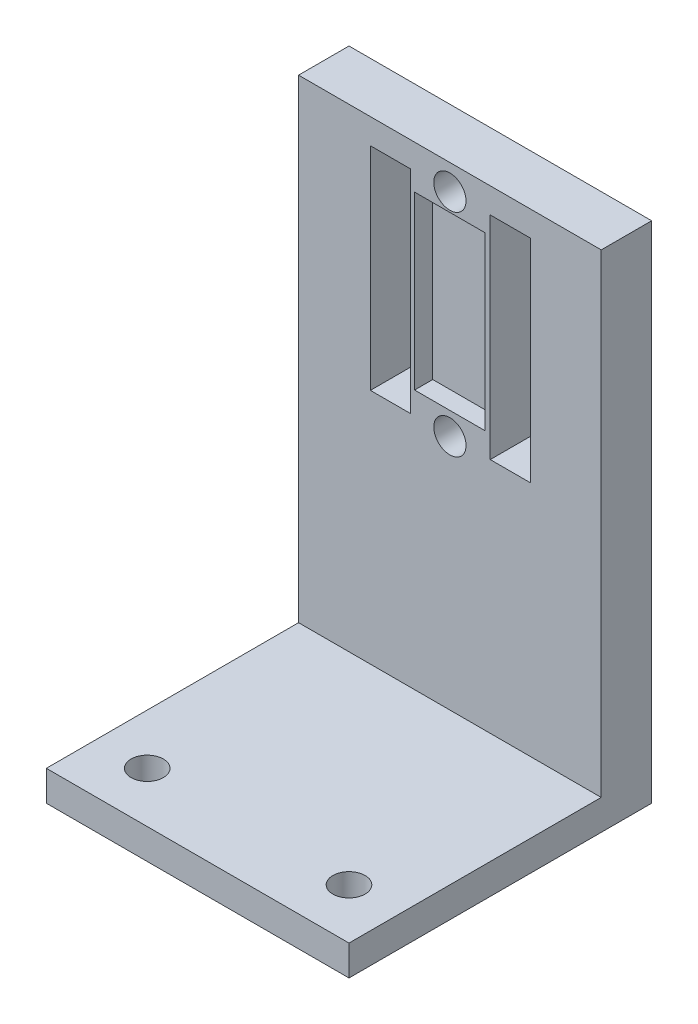
ISO-10303-21;
HEADER;
FILE_DESCRIPTION(('STEP AP214'),'2;1');
FILE_NAME('part.step','',(''),(''),'','','');
FILE_SCHEMA(('AUTOMOTIVE_DESIGN { 1 0 10303 214 1 1 1 1 }'));
ENDSEC;
DATA;
#1=APPLICATION_CONTEXT('core data for automotive mechanical design processes');
#2=APPLICATION_PROTOCOL_DEFINITION('international standard','automotive_design',2000,#1);
#3=PRODUCT_CONTEXT('',#1,'mechanical');
#4=PRODUCT('Part','Part','',(#3));
#5=PRODUCT_RELATED_PRODUCT_CATEGORY('part','',(#4));
#6=PRODUCT_DEFINITION_FORMATION('','',#4);
#7=PRODUCT_DEFINITION_CONTEXT('part definition',#1,'design');
#8=PRODUCT_DEFINITION('design','',#6,#7);
#9=PRODUCT_DEFINITION_SHAPE('','',#8);
#10=(LENGTH_UNIT() NAMED_UNIT(*) SI_UNIT(.MILLI.,.METRE.));
#11=(NAMED_UNIT(*) PLANE_ANGLE_UNIT() SI_UNIT($,.RADIAN.));
#12=(NAMED_UNIT(*) SI_UNIT($,.STERADIAN.) SOLID_ANGLE_UNIT());
#13=UNCERTAINTY_MEASURE_WITH_UNIT(LENGTH_MEASURE(1.E-05),#10,'distance_accuracy_value','');
#14=(GEOMETRIC_REPRESENTATION_CONTEXT(3) GLOBAL_UNCERTAINTY_ASSIGNED_CONTEXT((#13)) GLOBAL_UNIT_ASSIGNED_CONTEXT((#10,
#11,#12)) REPRESENTATION_CONTEXT('',''));
#15=CARTESIAN_POINT('',(0.,0.,0.));
#16=DIRECTION('',(0.,0.,1.));
#17=DIRECTION('',(1.,0.,0.));
#18=AXIS2_PLACEMENT_3D('',#15,#16,#17);
#19=CARTESIAN_POINT('',(15.,3.,0.));
#20=DIRECTION('',(1.,0.,0.));
#21=DIRECTION('',(0.,0.,-1.));
#22=AXIS2_PLACEMENT_3D('',#19,#20,#21);
#23=PLANE('',#22);
#24=DIRECTION('',(0.,0.,1.));
#25=VECTOR('',#24,1.);
#26=CARTESIAN_POINT('',(15.,0.,0.));
#27=LINE('',#26,#25);
#28=CARTESIAN_POINT('',(15.,0.,-30.));
#29=VERTEX_POINT('',#28);
#30=CARTESIAN_POINT('',(15.,0.,0.));
#31=VERTEX_POINT('',#30);
#32=EDGE_CURVE('E320',#29,#31,#27,.T.);
#33=ORIENTED_EDGE('',*,*,#32,.F.);
#34=DIRECTION('',(0.,-1.,0.));
#35=VECTOR('',#34,1.);
#36=CARTESIAN_POINT('',(15.,50.,-30.));
#37=LINE('',#36,#35);
#38=CARTESIAN_POINT('',(15.,50.,-30.));
#39=VERTEX_POINT('',#38);
#40=EDGE_CURVE('E287',#39,#29,#37,.T.);
#41=ORIENTED_EDGE('',*,*,#40,.F.);
#42=DIRECTION('',(0.,0.,1.));
#43=VECTOR('',#42,1.);
#44=CARTESIAN_POINT('',(15.,50.,0.));
#45=LINE('',#44,#43);
#46=CARTESIAN_POINT('',(15.,50.,-25.));
#47=VERTEX_POINT('',#46);
#48=EDGE_CURVE('E276',#39,#47,#45,.T.);
#49=ORIENTED_EDGE('',*,*,#48,.T.);
#50=DIRECTION('',(0.,-1.,0.));
#51=VECTOR('',#50,1.);
#52=CARTESIAN_POINT('',(15.,50.,-25.));
#53=LINE('',#52,#51);
#54=CARTESIAN_POINT('',(15.,3.,-25.));
#55=VERTEX_POINT('',#54);
#56=EDGE_CURVE('E290',#47,#55,#53,.T.);
#57=ORIENTED_EDGE('',*,*,#56,.T.);
#58=DIRECTION('',(0.,0.,1.));
#59=VECTOR('',#58,1.);
#60=CARTESIAN_POINT('',(15.,3.,0.));
#61=LINE('',#60,#59);
#62=CARTESIAN_POINT('',(15.,3.,0.));
#63=VERTEX_POINT('',#62);
#64=EDGE_CURVE('E304',#55,#63,#61,.T.);
#65=ORIENTED_EDGE('',*,*,#64,.T.);
#66=DIRECTION('',(0.,-1.,0.));
#67=VECTOR('',#66,1.);
#68=CARTESIAN_POINT('',(15.,3.,0.));
#69=LINE('',#68,#67);
#70=EDGE_CURVE('E42',#63,#31,#69,.T.);
#71=ORIENTED_EDGE('',*,*,#70,.T.);
#72=EDGE_LOOP('',(#33,#41,#49,#57,#65,#71));
#73=FACE_BOUND('',#72,.T.);
#74=ADVANCED_FACE('F34',(#73),#23,.T.);
#75=CARTESIAN_POINT('',(-15.,3.,0.));
#76=DIRECTION('',(-1.,0.,0.));
#77=DIRECTION('',(0.,0.,1.));
#78=AXIS2_PLACEMENT_3D('',#75,#76,#77);
#79=PLANE('',#78);
#80=DIRECTION('',(0.,0.,-1.));
#81=VECTOR('',#80,1.);
#82=CARTESIAN_POINT('',(-15.,0.,0.));
#83=LINE('',#82,#81);
#84=CARTESIAN_POINT('',(-15.,0.,0.));
#85=VERTEX_POINT('',#84);
#86=CARTESIAN_POINT('',(-15.,0.,-30.));
#87=VERTEX_POINT('',#86);
#88=EDGE_CURVE('E323',#85,#87,#83,.T.);
#89=ORIENTED_EDGE('',*,*,#88,.F.);
#90=DIRECTION('',(0.,-1.,0.));
#91=VECTOR('',#90,1.);
#92=CARTESIAN_POINT('',(-15.,3.,0.));
#93=LINE('',#92,#91);
#94=CARTESIAN_POINT('',(-15.,3.,0.));
#95=VERTEX_POINT('',#94);
#96=EDGE_CURVE('E11',#95,#85,#93,.T.);
#97=ORIENTED_EDGE('',*,*,#96,.F.);
#98=DIRECTION('',(0.,0.,-1.));
#99=VECTOR('',#98,1.);
#100=CARTESIAN_POINT('',(-15.,3.,0.));
#101=LINE('',#100,#99);
#102=CARTESIAN_POINT('',(-15.,3.,-25.));
#103=VERTEX_POINT('',#102);
#104=EDGE_CURVE('E310',#95,#103,#101,.T.);
#105=ORIENTED_EDGE('',*,*,#104,.T.);
#106=DIRECTION('',(0.,-1.,0.));
#107=VECTOR('',#106,1.);
#108=CARTESIAN_POINT('',(-15.,50.,-25.));
#109=LINE('',#108,#107);
#110=CARTESIAN_POINT('',(-15.,50.,-25.));
#111=VERTEX_POINT('',#110);
#112=EDGE_CURVE('E293',#111,#103,#109,.T.);
#113=ORIENTED_EDGE('',*,*,#112,.F.);
#114=DIRECTION('',(0.,0.,-1.));
#115=VECTOR('',#114,1.);
#116=CARTESIAN_POINT('',(-15.,50.,0.));
#117=LINE('',#116,#115);
#118=CARTESIAN_POINT('',(-15.,50.,-30.));
#119=VERTEX_POINT('',#118);
#120=EDGE_CURVE('E271',#111,#119,#117,.T.);
#121=ORIENTED_EDGE('',*,*,#120,.T.);
#122=DIRECTION('',(0.,-1.,0.));
#123=VECTOR('',#122,1.);
#124=CARTESIAN_POINT('',(-15.,50.,-30.));
#125=LINE('',#124,#123);
#126=EDGE_CURVE('E282',#119,#87,#125,.T.);
#127=ORIENTED_EDGE('',*,*,#126,.T.);
#128=EDGE_LOOP('',(#89,#97,#105,#113,#121,#127));
#129=FACE_BOUND('',#128,.T.);
#130=ADVANCED_FACE('F351',(#129),#79,.T.);
#131=CARTESIAN_POINT('',(-10.,3.,-5.));
#132=DIRECTION('',(0.,-1.,0.));
#133=DIRECTION('',(0.,0.,-1.));
#134=AXIS2_PLACEMENT_3D('',#131,#132,#133);
#135=CYLINDRICAL_SURFACE('',#134,1.6);
#136=CARTESIAN_POINT('',(-10.,3.,-5.));
#137=DIRECTION('',(0.,1.,0.));
#138=DIRECTION('',(0.,0.,1.));
#139=AXIS2_PLACEMENT_3D('',#136,#137,#138);
#140=CIRCLE('',#139,1.6);
#141=CARTESIAN_POINT('',(-10.,3.,-3.4));
#142=VERTEX_POINT('',#141);
#143=EDGE_CURVE('E300',#142,#142,#140,.T.);
#144=ORIENTED_EDGE('',*,*,#143,.T.);
#145=EDGE_LOOP('',(#144));
#146=FACE_BOUND('',#145,.T.);
#147=CARTESIAN_POINT('',(-10.,0.,-5.));
#148=DIRECTION('',(0.,1.,0.));
#149=DIRECTION('',(0.,0.,1.));
#150=AXIS2_PLACEMENT_3D('',#147,#148,#149);
#151=CIRCLE('',#150,1.6);
#152=CARTESIAN_POINT('',(-10.,0.,-3.4));
#153=VERTEX_POINT('',#152);
#154=EDGE_CURVE('E317',#153,#153,#151,.T.);
#155=ORIENTED_EDGE('',*,*,#154,.F.);
#156=EDGE_LOOP('',(#155));
#157=FACE_BOUND('',#156,.T.);
#158=ADVANCED_FACE('F353',(#146,#157),#135,.F.);
#159=CARTESIAN_POINT('',(10.,3.,-5.));
#160=DIRECTION('',(0.,-1.,0.));
#161=DIRECTION('',(0.,0.,-1.));
#162=AXIS2_PLACEMENT_3D('',#159,#160,#161);
#163=CYLINDRICAL_SURFACE('',#162,1.6);
#164=CARTESIAN_POINT('',(10.,3.,-5.));
#165=DIRECTION('',(0.,1.,0.));
#166=DIRECTION('',(0.,0.,1.));
#167=AXIS2_PLACEMENT_3D('',#164,#165,#166);
#168=CIRCLE('',#167,1.6);
#169=CARTESIAN_POINT('',(10.,3.,-3.4));
#170=VERTEX_POINT('',#169);
#171=EDGE_CURVE('E297',#170,#170,#168,.T.);
#172=ORIENTED_EDGE('',*,*,#171,.T.);
#173=EDGE_LOOP('',(#172));
#174=FACE_BOUND('',#173,.T.);
#175=CARTESIAN_POINT('',(10.,0.,-5.));
#176=DIRECTION('',(0.,1.,0.));
#177=DIRECTION('',(0.,0.,1.));
#178=AXIS2_PLACEMENT_3D('',#175,#176,#177);
#179=CIRCLE('',#178,1.6);
#180=CARTESIAN_POINT('',(10.,0.,-3.4));
#181=VERTEX_POINT('',#180);
#182=EDGE_CURVE('E296',#181,#181,#179,.T.);
#183=ORIENTED_EDGE('',*,*,#182,.F.);
#184=EDGE_LOOP('',(#183));
#185=FACE_BOUND('',#184,.T.);
#186=ADVANCED_FACE('F36',(#174,#185),#163,.F.);
#187=CARTESIAN_POINT('',(0.,3.,0.));
#188=DIRECTION('',(0.,0.,-1.));
#189=DIRECTION('',(-1.,0.,0.));
#190=AXIS2_PLACEMENT_3D('',#187,#188,#189);
#191=PLANE('',#190);
#192=DIRECTION('',(1.,0.,0.));
#193=VECTOR('',#192,1.);
#194=CARTESIAN_POINT('',(0.,0.,0.));
#195=LINE('',#194,#193);
#196=EDGE_CURVE('E301',#85,#31,#195,.T.);
#197=ORIENTED_EDGE('',*,*,#196,.T.);
#198=ORIENTED_EDGE('',*,*,#70,.F.);
#199=DIRECTION('',(1.,0.,0.));
#200=VECTOR('',#199,1.);
#201=CARTESIAN_POINT('',(0.,3.,0.));
#202=LINE('',#201,#200);
#203=EDGE_CURVE('E313',#95,#63,#202,.T.);
#204=ORIENTED_EDGE('',*,*,#203,.F.);
#205=ORIENTED_EDGE('',*,*,#96,.T.);
#206=EDGE_LOOP('',(#197,#198,#204,#205));
#207=FACE_BOUND('',#206,.T.);
#208=ADVANCED_FACE('F331',(#207),#191,.F.);
#209=CARTESIAN_POINT('',(0.,3.,0.));
#210=DIRECTION('',(0.,1.,0.));
#211=DIRECTION('',(0.,0.,1.));
#212=AXIS2_PLACEMENT_3D('',#209,#210,#211);
#213=PLANE('',#212);
#214=ORIENTED_EDGE('',*,*,#171,.F.);
#215=EDGE_LOOP('',(#214));
#216=FACE_BOUND('',#215,.T.);
#217=ORIENTED_EDGE('',*,*,#143,.F.);
#218=EDGE_LOOP('',(#217));
#219=FACE_BOUND('',#218,.T.);
#220=ORIENTED_EDGE('',*,*,#64,.F.);
#221=DIRECTION('',(1.,0.,0.));
#222=VECTOR('',#221,1.);
#223=CARTESIAN_POINT('',(0.,3.,-25.));
#224=LINE('',#223,#222);
#225=EDGE_CURVE('E307',#103,#55,#224,.T.);
#226=ORIENTED_EDGE('',*,*,#225,.F.);
#227=ORIENTED_EDGE('',*,*,#104,.F.);
#228=ORIENTED_EDGE('',*,*,#203,.T.);
#229=EDGE_LOOP('',(#220,#226,#227,#228));
#230=FACE_BOUND('',#229,.T.);
#231=ADVANCED_FACE('F349',(#216,#219,#230),#213,.T.);
#232=CARTESIAN_POINT('',(0.,0.,0.));
#233=DIRECTION('',(0.,1.,0.));
#234=DIRECTION('',(0.,0.,1.));
#235=AXIS2_PLACEMENT_3D('',#232,#233,#234);
#236=PLANE('',#235);
#237=ORIENTED_EDGE('',*,*,#182,.T.);
#238=EDGE_LOOP('',(#237));
#239=FACE_BOUND('',#238,.T.);
#240=ORIENTED_EDGE('',*,*,#154,.T.);
#241=EDGE_LOOP('',(#240));
#242=FACE_BOUND('',#241,.T.);
#243=ORIENTED_EDGE('',*,*,#32,.T.);
#244=ORIENTED_EDGE('',*,*,#196,.F.);
#245=ORIENTED_EDGE('',*,*,#88,.T.);
#246=DIRECTION('',(1.,0.,0.));
#247=VECTOR('',#246,1.);
#248=CARTESIAN_POINT('',(0.,0.,-30.));
#249=LINE('',#248,#247);
#250=EDGE_CURVE('E268',#87,#29,#249,.T.);
#251=ORIENTED_EDGE('',*,*,#250,.T.);
#252=EDGE_LOOP('',(#243,#244,#245,#251));
#253=FACE_BOUND('',#252,.T.);
#254=ADVANCED_FACE('F334',(#239,#242,#253),#236,.F.);
#255=CARTESIAN_POINT('',(0.,50.,-25.));
#256=DIRECTION('',(0.,0.,-1.));
#257=DIRECTION('',(-1.,0.,0.));
#258=AXIS2_PLACEMENT_3D('',#255,#256,#257);
#259=PLANE('',#258);
#260=DIRECTION('',(1.,0.,0.));
#261=VECTOR('',#260,1.);
#262=CARTESIAN_POINT('',(-3.5,28.7198675068723,-25.));
#263=LINE('',#262,#261);
#264=CARTESIAN_POINT('',(-3.5,28.7198675068723,-25.));
#265=VERTEX_POINT('',#264);
#266=CARTESIAN_POINT('',(3.5,28.7198675068723,-25.));
#267=VERTEX_POINT('',#266);
#268=EDGE_CURVE('E187',#265,#267,#263,.T.);
#269=ORIENTED_EDGE('',*,*,#268,.F.);
#270=DIRECTION('',(0.,-1.,0.));
#271=VECTOR('',#270,1.);
#272=CARTESIAN_POINT('',(-3.5,28.7198675068723,-25.));
#273=LINE('',#272,#271);
#274=CARTESIAN_POINT('',(-3.5,45.7130165422583,-25.));
#275=VERTEX_POINT('',#274);
#276=EDGE_CURVE('E49',#275,#265,#273,.T.);
#277=ORIENTED_EDGE('',*,*,#276,.F.);
#278=DIRECTION('',(-1.,0.,0.));
#279=VECTOR('',#278,1.);
#280=CARTESIAN_POINT('',(-3.5,45.7130165422583,-25.));
#281=LINE('',#280,#279);
#282=CARTESIAN_POINT('',(3.5,45.7130165422583,-25.));
#283=VERTEX_POINT('',#282);
#284=EDGE_CURVE('E178',#283,#275,#281,.T.);
#285=ORIENTED_EDGE('',*,*,#284,.F.);
#286=DIRECTION('',(0.,1.,0.));
#287=VECTOR('',#286,1.);
#288=CARTESIAN_POINT('',(3.5,45.7130165422583,-25.));
#289=LINE('',#288,#287);
#290=EDGE_CURVE('E181',#267,#283,#289,.T.);
#291=ORIENTED_EDGE('',*,*,#290,.F.);
#292=EDGE_LOOP('',(#269,#277,#285,#291));
#293=FACE_BOUND('',#292,.T.);
#294=DIRECTION('',(1.,0.,0.));
#295=VECTOR('',#294,1.);
#296=CARTESIAN_POINT('',(-3.87991739207283,26.5,-25.));
#297=LINE('',#296,#295);
#298=CARTESIAN_POINT('',(-7.87991739207283,26.5,-25.));
#299=VERTEX_POINT('',#298);
#300=CARTESIAN_POINT('',(-3.87991739207283,26.5,-25.));
#301=VERTEX_POINT('',#300);
#302=EDGE_CURVE('E245',#299,#301,#297,.T.);
#303=ORIENTED_EDGE('',*,*,#302,.F.);
#304=DIRECTION('',(0.,-1.,0.));
#305=VECTOR('',#304,1.);
#306=CARTESIAN_POINT('',(-7.87991739207283,26.5,-25.));
#307=LINE('',#306,#305);
#308=CARTESIAN_POINT('',(-7.87991739207283,47.5,-25.));
#309=VERTEX_POINT('',#308);
#310=EDGE_CURVE('E57',#309,#299,#307,.T.);
#311=ORIENTED_EDGE('',*,*,#310,.F.);
#312=DIRECTION('',(-1.,0.,0.));
#313=VECTOR('',#312,1.);
#314=CARTESIAN_POINT('',(-7.87991739207283,47.5,-25.));
#315=LINE('',#314,#313);
#316=CARTESIAN_POINT('',(-3.87991739207283,47.5,-25.));
#317=VERTEX_POINT('',#316);
#318=EDGE_CURVE('E234',#317,#309,#315,.T.);
#319=ORIENTED_EDGE('',*,*,#318,.F.);
#320=DIRECTION('',(0.,1.,0.));
#321=VECTOR('',#320,1.);
#322=CARTESIAN_POINT('',(-3.87991739207283,47.5,-25.));
#323=LINE('',#322,#321);
#324=EDGE_CURVE('E248',#301,#317,#323,.T.);
#325=ORIENTED_EDGE('',*,*,#324,.F.);
#326=EDGE_LOOP('',(#303,#311,#319,#325));
#327=FACE_BOUND('',#326,.T.);
#328=DIRECTION('',(1.,0.,0.));
#329=VECTOR('',#328,1.);
#330=CARTESIAN_POINT('',(4.,26.5,-25.));
#331=LINE('',#330,#329);
#332=CARTESIAN_POINT('',(4.,26.5,-25.));
#333=VERTEX_POINT('',#332);
#334=CARTESIAN_POINT('',(8.,26.5,-25.));
#335=VERTEX_POINT('',#334);
#336=EDGE_CURVE('E212',#333,#335,#331,.T.);
#337=ORIENTED_EDGE('',*,*,#336,.F.);
#338=DIRECTION('',(0.,-1.,0.));
#339=VECTOR('',#338,1.);
#340=CARTESIAN_POINT('',(4.,47.5,-25.));
#341=LINE('',#340,#339);
#342=CARTESIAN_POINT('',(4.,47.5,-25.));
#343=VERTEX_POINT('',#342);
#344=EDGE_CURVE('E210',#343,#333,#341,.T.);
#345=ORIENTED_EDGE('',*,*,#344,.F.);
#346=DIRECTION('',(-1.,0.,0.));
#347=VECTOR('',#346,1.);
#348=CARTESIAN_POINT('',(8.,47.5,-25.));
#349=LINE('',#348,#347);
#350=CARTESIAN_POINT('',(8.,47.5,-25.));
#351=VERTEX_POINT('',#350);
#352=EDGE_CURVE('E200',#351,#343,#349,.T.);
#353=ORIENTED_EDGE('',*,*,#352,.F.);
#354=DIRECTION('',(0.,1.,0.));
#355=VECTOR('',#354,1.);
#356=CARTESIAN_POINT('',(8.,26.5,-25.));
#357=LINE('',#356,#355);
#358=EDGE_CURVE('E216',#335,#351,#357,.T.);
#359=ORIENTED_EDGE('',*,*,#358,.F.);
#360=EDGE_LOOP('',(#337,#345,#353,#359));
#361=FACE_BOUND('',#360,.T.);
#362=CARTESIAN_POINT('',(0.,26.5,-25.));
#363=DIRECTION('',(0.,0.,1.));
#364=DIRECTION('',(1.,0.,0.));
#365=AXIS2_PLACEMENT_3D('',#362,#363,#364);
#366=CIRCLE('',#365,1.6);
#367=CARTESIAN_POINT('',(1.6,26.5,-25.));
#368=VERTEX_POINT('',#367);
#369=EDGE_CURVE('E223',#368,#368,#366,.T.);
#370=ORIENTED_EDGE('',*,*,#369,.F.);
#371=EDGE_LOOP('',(#370));
#372=FACE_BOUND('',#371,.T.);
#373=CARTESIAN_POINT('',(0.,47.5,-25.));
#374=DIRECTION('',(0.,0.,1.));
#375=DIRECTION('',(1.,0.,0.));
#376=AXIS2_PLACEMENT_3D('',#373,#374,#375);
#377=CIRCLE('',#376,1.6);
#378=CARTESIAN_POINT('',(1.6,47.5,-25.));
#379=VERTEX_POINT('',#378);
#380=EDGE_CURVE('E262',#379,#379,#377,.T.);
#381=ORIENTED_EDGE('',*,*,#380,.F.);
#382=EDGE_LOOP('',(#381));
#383=FACE_BOUND('',#382,.T.);
#384=ORIENTED_EDGE('',*,*,#112,.T.);
#385=ORIENTED_EDGE('',*,*,#225,.T.);
#386=ORIENTED_EDGE('',*,*,#56,.F.);
#387=DIRECTION('',(1.,0.,0.));
#388=VECTOR('',#387,1.);
#389=CARTESIAN_POINT('',(0.,50.,-25.));
#390=LINE('',#389,#388);
#391=EDGE_CURVE('E274',#111,#47,#390,.T.);
#392=ORIENTED_EDGE('',*,*,#391,.F.);
#393=EDGE_LOOP('',(#384,#385,#386,#392));
#394=FACE_BOUND('',#393,.T.);
#395=ADVANCED_FACE('F346',(#293,#327,#361,#372,#383,#394),#259,.F.);
#396=CARTESIAN_POINT('',(0.,50.,-30.));
#397=DIRECTION('',(0.,0.,-1.));
#398=DIRECTION('',(-1.,0.,0.));
#399=AXIS2_PLACEMENT_3D('',#396,#397,#398);
#400=PLANE('',#399);
#401=DIRECTION('',(0.,-1.,0.));
#402=VECTOR('',#401,1.);
#403=CARTESIAN_POINT('',(-7.87991739207283,26.5,-30.));
#404=LINE('',#403,#402);
#405=CARTESIAN_POINT('',(-7.87991739207283,47.5,-30.));
#406=VERTEX_POINT('',#405);
#407=CARTESIAN_POINT('',(-7.87991739207283,26.5,-30.));
#408=VERTEX_POINT('',#407);
#409=EDGE_CURVE('E230',#406,#408,#404,.T.);
#410=ORIENTED_EDGE('',*,*,#409,.T.);
#411=DIRECTION('',(1.,0.,0.));
#412=VECTOR('',#411,1.);
#413=CARTESIAN_POINT('',(-3.87991739207283,26.5,-30.));
#414=LINE('',#413,#412);
#415=CARTESIAN_POINT('',(-3.87991739207283,26.5,-30.));
#416=VERTEX_POINT('',#415);
#417=EDGE_CURVE('E233',#408,#416,#414,.T.);
#418=ORIENTED_EDGE('',*,*,#417,.T.);
#419=DIRECTION('',(0.,1.,0.));
#420=VECTOR('',#419,1.);
#421=CARTESIAN_POINT('',(-3.87991739207283,47.5,-30.));
#422=LINE('',#421,#420);
#423=CARTESIAN_POINT('',(-3.87991739207283,47.5,-30.));
#424=VERTEX_POINT('',#423);
#425=EDGE_CURVE('E237',#416,#424,#422,.T.);
#426=ORIENTED_EDGE('',*,*,#425,.T.);
#427=DIRECTION('',(-1.,0.,0.));
#428=VECTOR('',#427,1.);
#429=CARTESIAN_POINT('',(-7.87991739207283,47.5,-30.));
#430=LINE('',#429,#428);
#431=EDGE_CURVE('E240',#424,#406,#430,.T.);
#432=ORIENTED_EDGE('',*,*,#431,.T.);
#433=EDGE_LOOP('',(#410,#418,#426,#432));
#434=FACE_BOUND('',#433,.T.);
#435=DIRECTION('',(0.,-1.,0.));
#436=VECTOR('',#435,1.);
#437=CARTESIAN_POINT('',(4.,47.5,-30.));
#438=LINE('',#437,#436);
#439=CARTESIAN_POINT('',(4.,47.5,-30.));
#440=VERTEX_POINT('',#439);
#441=CARTESIAN_POINT('',(4.,26.5,-30.));
#442=VERTEX_POINT('',#441);
#443=EDGE_CURVE('E196',#440,#442,#438,.T.);
#444=ORIENTED_EDGE('',*,*,#443,.T.);
#445=DIRECTION('',(1.,0.,0.));
#446=VECTOR('',#445,1.);
#447=CARTESIAN_POINT('',(4.,26.5,-30.));
#448=LINE('',#447,#446);
#449=CARTESIAN_POINT('',(8.,26.5,-30.));
#450=VERTEX_POINT('',#449);
#451=EDGE_CURVE('E199',#442,#450,#448,.T.);
#452=ORIENTED_EDGE('',*,*,#451,.T.);
#453=DIRECTION('',(0.,1.,0.));
#454=VECTOR('',#453,1.);
#455=CARTESIAN_POINT('',(8.,26.5,-30.));
#456=LINE('',#455,#454);
#457=CARTESIAN_POINT('',(8.,47.5,-30.));
#458=VERTEX_POINT('',#457);
#459=EDGE_CURVE('E203',#450,#458,#456,.T.);
#460=ORIENTED_EDGE('',*,*,#459,.T.);
#461=DIRECTION('',(-1.,0.,0.));
#462=VECTOR('',#461,1.);
#463=CARTESIAN_POINT('',(8.,47.5,-30.));
#464=LINE('',#463,#462);
#465=EDGE_CURVE('E206',#458,#440,#464,.T.);
#466=ORIENTED_EDGE('',*,*,#465,.T.);
#467=EDGE_LOOP('',(#444,#452,#460,#466));
#468=FACE_BOUND('',#467,.T.);
#469=CARTESIAN_POINT('',(0.,26.5,-30.));
#470=DIRECTION('',(0.,0.,1.));
#471=DIRECTION('',(1.,0.,0.));
#472=AXIS2_PLACEMENT_3D('',#469,#470,#471);
#473=CIRCLE('',#472,1.6);
#474=CARTESIAN_POINT('',(1.6,26.5,-30.));
#475=VERTEX_POINT('',#474);
#476=EDGE_CURVE('E259',#475,#475,#473,.T.);
#477=ORIENTED_EDGE('',*,*,#476,.T.);
#478=EDGE_LOOP('',(#477));
#479=FACE_BOUND('',#478,.T.);
#480=CARTESIAN_POINT('',(0.,47.5,-30.));
#481=DIRECTION('',(0.,0.,1.));
#482=DIRECTION('',(1.,0.,0.));
#483=AXIS2_PLACEMENT_3D('',#480,#481,#482);
#484=CIRCLE('',#483,1.6);
#485=CARTESIAN_POINT('',(1.6,47.5,-30.));
#486=VERTEX_POINT('',#485);
#487=EDGE_CURVE('E265',#486,#486,#484,.T.);
#488=ORIENTED_EDGE('',*,*,#487,.T.);
#489=EDGE_LOOP('',(#488));
#490=FACE_BOUND('',#489,.T.);
#491=ORIENTED_EDGE('',*,*,#250,.F.);
#492=ORIENTED_EDGE('',*,*,#126,.F.);
#493=DIRECTION('',(1.,0.,0.));
#494=VECTOR('',#493,1.);
#495=CARTESIAN_POINT('',(0.,50.,-30.));
#496=LINE('',#495,#494);
#497=EDGE_CURVE('E279',#119,#39,#496,.T.);
#498=ORIENTED_EDGE('',*,*,#497,.T.);
#499=ORIENTED_EDGE('',*,*,#40,.T.);
#500=EDGE_LOOP('',(#491,#492,#498,#499));
#501=FACE_BOUND('',#500,.T.);
#502=ADVANCED_FACE('F337',(#434,#468,#479,#490,#501),#400,.T.);
#503=CARTESIAN_POINT('',(0.,50.,0.));
#504=DIRECTION('',(0.,1.,0.));
#505=DIRECTION('',(0.,0.,1.));
#506=AXIS2_PLACEMENT_3D('',#503,#504,#505);
#507=PLANE('',#506);
#508=ORIENTED_EDGE('',*,*,#120,.F.);
#509=ORIENTED_EDGE('',*,*,#391,.T.);
#510=ORIENTED_EDGE('',*,*,#48,.F.);
#511=ORIENTED_EDGE('',*,*,#497,.F.);
#512=EDGE_LOOP('',(#508,#509,#510,#511));
#513=FACE_BOUND('',#512,.T.);
#514=ADVANCED_FACE('F342',(#513),#507,.T.);
#515=CARTESIAN_POINT('',(0.,47.5,-30.));
#516=DIRECTION('',(0.,0.,1.));
#517=DIRECTION('',(1.,0.,0.));
#518=AXIS2_PLACEMENT_3D('',#515,#516,#517);
#519=CYLINDRICAL_SURFACE('',#518,1.6);
#520=ORIENTED_EDGE('',*,*,#487,.F.);
#521=EDGE_LOOP('',(#520));
#522=FACE_BOUND('',#521,.T.);
#523=ORIENTED_EDGE('',*,*,#380,.T.);
#524=EDGE_LOOP('',(#523));
#525=FACE_BOUND('',#524,.T.);
#526=ADVANCED_FACE('F378',(#522,#525),#519,.F.);
#527=CARTESIAN_POINT('',(0.,26.5,-30.));
#528=DIRECTION('',(0.,0.,1.));
#529=DIRECTION('',(1.,0.,0.));
#530=AXIS2_PLACEMENT_3D('',#527,#528,#529);
#531=CYLINDRICAL_SURFACE('',#530,1.6);
#532=ORIENTED_EDGE('',*,*,#476,.F.);
#533=EDGE_LOOP('',(#532));
#534=FACE_BOUND('',#533,.T.);
#535=ORIENTED_EDGE('',*,*,#369,.T.);
#536=EDGE_LOOP('',(#535));
#537=FACE_BOUND('',#536,.T.);
#538=ADVANCED_FACE('F381',(#534,#537),#531,.F.);
#539=CARTESIAN_POINT('',(4.,47.5,-30.));
#540=DIRECTION('',(-1.,0.,0.));
#541=DIRECTION('',(0.,0.,1.));
#542=AXIS2_PLACEMENT_3D('',#539,#540,#541);
#543=PLANE('',#542);
#544=ORIENTED_EDGE('',*,*,#344,.T.);
#545=DIRECTION('',(0.,0.,1.));
#546=VECTOR('',#545,1.);
#547=CARTESIAN_POINT('',(4.,26.5,-30.));
#548=LINE('',#547,#546);
#549=EDGE_CURVE('E209',#442,#333,#548,.T.);
#550=ORIENTED_EDGE('',*,*,#549,.F.);
#551=ORIENTED_EDGE('',*,*,#443,.F.);
#552=DIRECTION('',(0.,0.,1.));
#553=VECTOR('',#552,1.);
#554=CARTESIAN_POINT('',(4.,47.5,-30.));
#555=LINE('',#554,#553);
#556=EDGE_CURVE('E221',#440,#343,#555,.T.);
#557=ORIENTED_EDGE('',*,*,#556,.T.);
#558=EDGE_LOOP('',(#544,#550,#551,#557));
#559=FACE_BOUND('',#558,.T.);
#560=ADVANCED_FACE('F385',(#559),#543,.F.);
#561=CARTESIAN_POINT('',(8.,47.5,-30.));
#562=DIRECTION('',(0.,1.,0.));
#563=DIRECTION('',(0.,0.,1.));
#564=AXIS2_PLACEMENT_3D('',#561,#562,#563);
#565=PLANE('',#564);
#566=ORIENTED_EDGE('',*,*,#352,.T.);
#567=ORIENTED_EDGE('',*,*,#556,.F.);
#568=ORIENTED_EDGE('',*,*,#465,.F.);
#569=DIRECTION('',(0.,0.,1.));
#570=VECTOR('',#569,1.);
#571=CARTESIAN_POINT('',(8.,47.5,-30.));
#572=LINE('',#571,#570);
#573=EDGE_CURVE('E224',#458,#351,#572,.T.);
#574=ORIENTED_EDGE('',*,*,#573,.T.);
#575=EDGE_LOOP('',(#566,#567,#568,#574));
#576=FACE_BOUND('',#575,.T.);
#577=ADVANCED_FACE('F405',(#576),#565,.F.);
#578=CARTESIAN_POINT('',(8.,26.5,-30.));
#579=DIRECTION('',(1.,0.,0.));
#580=DIRECTION('',(0.,0.,-1.));
#581=AXIS2_PLACEMENT_3D('',#578,#579,#580);
#582=PLANE('',#581);
#583=ORIENTED_EDGE('',*,*,#358,.T.);
#584=ORIENTED_EDGE('',*,*,#573,.F.);
#585=ORIENTED_EDGE('',*,*,#459,.F.);
#586=DIRECTION('',(0.,0.,1.));
#587=VECTOR('',#586,1.);
#588=CARTESIAN_POINT('',(8.,26.5,-30.));
#589=LINE('',#588,#587);
#590=EDGE_CURVE('E226',#450,#335,#589,.T.);
#591=ORIENTED_EDGE('',*,*,#590,.T.);
#592=EDGE_LOOP('',(#583,#584,#585,#591));
#593=FACE_BOUND('',#592,.T.);
#594=ADVANCED_FACE('F409',(#593),#582,.F.);
#595=CARTESIAN_POINT('',(4.,26.5,-30.));
#596=DIRECTION('',(0.,-1.,0.));
#597=DIRECTION('',(0.,0.,-1.));
#598=AXIS2_PLACEMENT_3D('',#595,#596,#597);
#599=PLANE('',#598);
#600=ORIENTED_EDGE('',*,*,#336,.T.);
#601=ORIENTED_EDGE('',*,*,#590,.F.);
#602=ORIENTED_EDGE('',*,*,#451,.F.);
#603=ORIENTED_EDGE('',*,*,#549,.T.);
#604=EDGE_LOOP('',(#600,#601,#602,#603));
#605=FACE_BOUND('',#604,.T.);
#606=ADVANCED_FACE('F391',(#605),#599,.F.);
#607=CARTESIAN_POINT('',(-7.87991739207283,26.5,-30.));
#608=DIRECTION('',(-1.,0.,0.));
#609=DIRECTION('',(0.,0.,1.));
#610=AXIS2_PLACEMENT_3D('',#607,#608,#609);
#611=PLANE('',#610);
#612=ORIENTED_EDGE('',*,*,#310,.T.);
#613=DIRECTION('',(0.,0.,1.));
#614=VECTOR('',#613,1.);
#615=CARTESIAN_POINT('',(-7.87991739207283,26.5,-30.));
#616=LINE('',#615,#614);
#617=EDGE_CURVE('E243',#408,#299,#616,.T.);
#618=ORIENTED_EDGE('',*,*,#617,.F.);
#619=ORIENTED_EDGE('',*,*,#409,.F.);
#620=DIRECTION('',(0.,0.,1.));
#621=VECTOR('',#620,1.);
#622=CARTESIAN_POINT('',(-7.87991739207283,47.5,-30.));
#623=LINE('',#622,#621);
#624=EDGE_CURVE('E213',#406,#309,#623,.T.);
#625=ORIENTED_EDGE('',*,*,#624,.T.);
#626=EDGE_LOOP('',(#612,#618,#619,#625));
#627=FACE_BOUND('',#626,.T.);
#628=ADVANCED_FACE('F387',(#627),#611,.F.);
#629=CARTESIAN_POINT('',(-7.87991739207283,47.5,-30.));
#630=DIRECTION('',(0.,1.,0.));
#631=DIRECTION('',(0.,0.,1.));
#632=AXIS2_PLACEMENT_3D('',#629,#630,#631);
#633=PLANE('',#632);
#634=ORIENTED_EDGE('',*,*,#318,.T.);
#635=ORIENTED_EDGE('',*,*,#624,.F.);
#636=ORIENTED_EDGE('',*,*,#431,.F.);
#637=DIRECTION('',(0.,0.,1.));
#638=VECTOR('',#637,1.);
#639=CARTESIAN_POINT('',(-3.87991739207283,47.5,-30.));
#640=LINE('',#639,#638);
#641=EDGE_CURVE('E254',#424,#317,#640,.T.);
#642=ORIENTED_EDGE('',*,*,#641,.T.);
#643=EDGE_LOOP('',(#634,#635,#636,#642));
#644=FACE_BOUND('',#643,.T.);
#645=ADVANCED_FACE('F390',(#644),#633,.F.);
#646=CARTESIAN_POINT('',(-3.87991739207283,47.5,-30.));
#647=DIRECTION('',(1.,0.,0.));
#648=DIRECTION('',(0.,0.,-1.));
#649=AXIS2_PLACEMENT_3D('',#646,#647,#648);
#650=PLANE('',#649);
#651=ORIENTED_EDGE('',*,*,#324,.T.);
#652=ORIENTED_EDGE('',*,*,#641,.F.);
#653=ORIENTED_EDGE('',*,*,#425,.F.);
#654=DIRECTION('',(0.,0.,1.));
#655=VECTOR('',#654,1.);
#656=CARTESIAN_POINT('',(-3.87991739207283,26.5,-30.));
#657=LINE('',#656,#655);
#658=EDGE_CURVE('E256',#416,#301,#657,.T.);
#659=ORIENTED_EDGE('',*,*,#658,.T.);
#660=EDGE_LOOP('',(#651,#652,#653,#659));
#661=FACE_BOUND('',#660,.T.);
#662=ADVANCED_FACE('F395',(#661),#650,.F.);
#663=CARTESIAN_POINT('',(-3.87991739207283,26.5,-30.));
#664=DIRECTION('',(0.,-1.,0.));
#665=DIRECTION('',(0.,0.,-1.));
#666=AXIS2_PLACEMENT_3D('',#663,#664,#665);
#667=PLANE('',#666);
#668=ORIENTED_EDGE('',*,*,#302,.T.);
#669=ORIENTED_EDGE('',*,*,#658,.F.);
#670=ORIENTED_EDGE('',*,*,#417,.F.);
#671=ORIENTED_EDGE('',*,*,#617,.T.);
#672=EDGE_LOOP('',(#668,#669,#670,#671));
#673=FACE_BOUND('',#672,.T.);
#674=ADVANCED_FACE('F392',(#673),#667,.F.);
#675=CARTESIAN_POINT('',(-3.5,28.7198675068723,-26.8));
#676=DIRECTION('',(-1.,0.,0.));
#677=DIRECTION('',(0.,0.,1.));
#678=AXIS2_PLACEMENT_3D('',#675,#676,#677);
#679=PLANE('',#678);
#680=ORIENTED_EDGE('',*,*,#276,.T.);
#681=DIRECTION('',(0.,0.,1.));
#682=VECTOR('',#681,1.);
#683=CARTESIAN_POINT('',(-3.5,28.7198675068723,-26.8));
#684=LINE('',#683,#682);
#685=CARTESIAN_POINT('',(-3.5,28.7198675068723,-26.8));
#686=VERTEX_POINT('',#685);
#687=EDGE_CURVE('E156',#686,#265,#684,.T.);
#688=ORIENTED_EDGE('',*,*,#687,.F.);
#689=DIRECTION('',(0.,-1.,0.));
#690=VECTOR('',#689,1.);
#691=CARTESIAN_POINT('',(-3.5,28.7198675068723,-26.8));
#692=LINE('',#691,#690);
#693=CARTESIAN_POINT('',(-3.5,45.7130165422583,-26.8));
#694=VERTEX_POINT('',#693);
#695=EDGE_CURVE('E160',#694,#686,#692,.T.);
#696=ORIENTED_EDGE('',*,*,#695,.F.);
#697=DIRECTION('',(0.,0.,1.));
#698=VECTOR('',#697,1.);
#699=CARTESIAN_POINT('',(-3.5,45.7130165422583,-26.8));
#700=LINE('',#699,#698);
#701=EDGE_CURVE('E191',#694,#275,#700,.T.);
#702=ORIENTED_EDGE('',*,*,#701,.T.);
#703=EDGE_LOOP('',(#680,#688,#696,#702));
#704=FACE_BOUND('',#703,.T.);
#705=ADVANCED_FACE('F158',(#704),#679,.F.);
#706=CARTESIAN_POINT('',(-3.5,45.7130165422583,-26.8));
#707=DIRECTION('',(0.,1.,0.));
#708=DIRECTION('',(0.,0.,1.));
#709=AXIS2_PLACEMENT_3D('',#706,#707,#708);
#710=PLANE('',#709);
#711=ORIENTED_EDGE('',*,*,#284,.T.);
#712=ORIENTED_EDGE('',*,*,#701,.F.);
#713=DIRECTION('',(-1.,0.,0.));
#714=VECTOR('',#713,1.);
#715=CARTESIAN_POINT('',(-3.5,45.7130165422583,-26.8));
#716=LINE('',#715,#714);
#717=CARTESIAN_POINT('',(3.5,45.7130165422583,-26.8));
#718=VERTEX_POINT('',#717);
#719=EDGE_CURVE('E166',#718,#694,#716,.T.);
#720=ORIENTED_EDGE('',*,*,#719,.F.);
#721=DIRECTION('',(0.,0.,1.));
#722=VECTOR('',#721,1.);
#723=CARTESIAN_POINT('',(3.5,45.7130165422583,-26.8));
#724=LINE('',#723,#722);
#725=EDGE_CURVE('E193',#718,#283,#724,.T.);
#726=ORIENTED_EDGE('',*,*,#725,.T.);
#727=EDGE_LOOP('',(#711,#712,#720,#726));
#728=FACE_BOUND('',#727,.T.);
#729=ADVANCED_FACE('F419',(#728),#710,.F.);
#730=CARTESIAN_POINT('',(3.5,45.7130165422583,-26.8));
#731=DIRECTION('',(1.,0.,0.));
#732=DIRECTION('',(0.,0.,-1.));
#733=AXIS2_PLACEMENT_3D('',#730,#731,#732);
#734=PLANE('',#733);
#735=ORIENTED_EDGE('',*,*,#290,.T.);
#736=ORIENTED_EDGE('',*,*,#725,.F.);
#737=DIRECTION('',(0.,1.,0.));
#738=VECTOR('',#737,1.);
#739=CARTESIAN_POINT('',(3.5,45.7130165422583,-26.8));
#740=LINE('',#739,#738);
#741=CARTESIAN_POINT('',(3.5,28.7198675068723,-26.8));
#742=VERTEX_POINT('',#741);
#743=EDGE_CURVE('E174',#742,#718,#740,.T.);
#744=ORIENTED_EDGE('',*,*,#743,.F.);
#745=DIRECTION('',(0.,0.,1.));
#746=VECTOR('',#745,1.);
#747=CARTESIAN_POINT('',(3.5,28.7198675068723,-26.8));
#748=LINE('',#747,#746);
#749=EDGE_CURVE('E165',#742,#267,#748,.T.);
#750=ORIENTED_EDGE('',*,*,#749,.T.);
#751=EDGE_LOOP('',(#735,#736,#744,#750));
#752=FACE_BOUND('',#751,.T.);
#753=ADVANCED_FACE('F422',(#752),#734,.F.);
#754=CARTESIAN_POINT('',(-3.5,28.7198675068723,-26.8));
#755=DIRECTION('',(0.,-1.,0.));
#756=DIRECTION('',(0.,0.,-1.));
#757=AXIS2_PLACEMENT_3D('',#754,#755,#756);
#758=PLANE('',#757);
#759=ORIENTED_EDGE('',*,*,#268,.T.);
#760=ORIENTED_EDGE('',*,*,#749,.F.);
#761=DIRECTION('',(1.,0.,0.));
#762=VECTOR('',#761,1.);
#763=CARTESIAN_POINT('',(-3.5,28.7198675068723,-26.8));
#764=LINE('',#763,#762);
#765=EDGE_CURVE('E169',#686,#742,#764,.T.);
#766=ORIENTED_EDGE('',*,*,#765,.F.);
#767=ORIENTED_EDGE('',*,*,#687,.T.);
#768=EDGE_LOOP('',(#759,#760,#766,#767));
#769=FACE_BOUND('',#768,.T.);
#770=ADVANCED_FACE('F170',(#769),#758,.F.);
#771=CARTESIAN_POINT('',(0.,0.,-26.8));
#772=DIRECTION('',(0.,0.,-1.));
#773=DIRECTION('',(-1.,0.,0.));
#774=AXIS2_PLACEMENT_3D('',#771,#772,#773);
#775=PLANE('',#774);
#776=ORIENTED_EDGE('',*,*,#695,.T.);
#777=ORIENTED_EDGE('',*,*,#765,.T.);
#778=ORIENTED_EDGE('',*,*,#743,.T.);
#779=ORIENTED_EDGE('',*,*,#719,.T.);
#780=EDGE_LOOP('',(#776,#777,#778,#779));
#781=FACE_BOUND('',#780,.T.);
#782=ADVANCED_FACE('F176',(#781),#775,.F.);
#783=CLOSED_SHELL('',(#74,#130,#158,#186,#208,#231,#254,#395,#502,#514,#526,#538,#560,#577,#594,
#606,#628,#645,#662,#674,#705,#729,#753,#770,#782));
#784=MANIFOLD_SOLID_BREP('B2',#783);
#785=ADVANCED_BREP_SHAPE_REPRESENTATION('',(#18,#784),#14);
#786=SHAPE_DEFINITION_REPRESENTATION(#9,#785);
ENDSEC;
END-ISO-10303-21;
